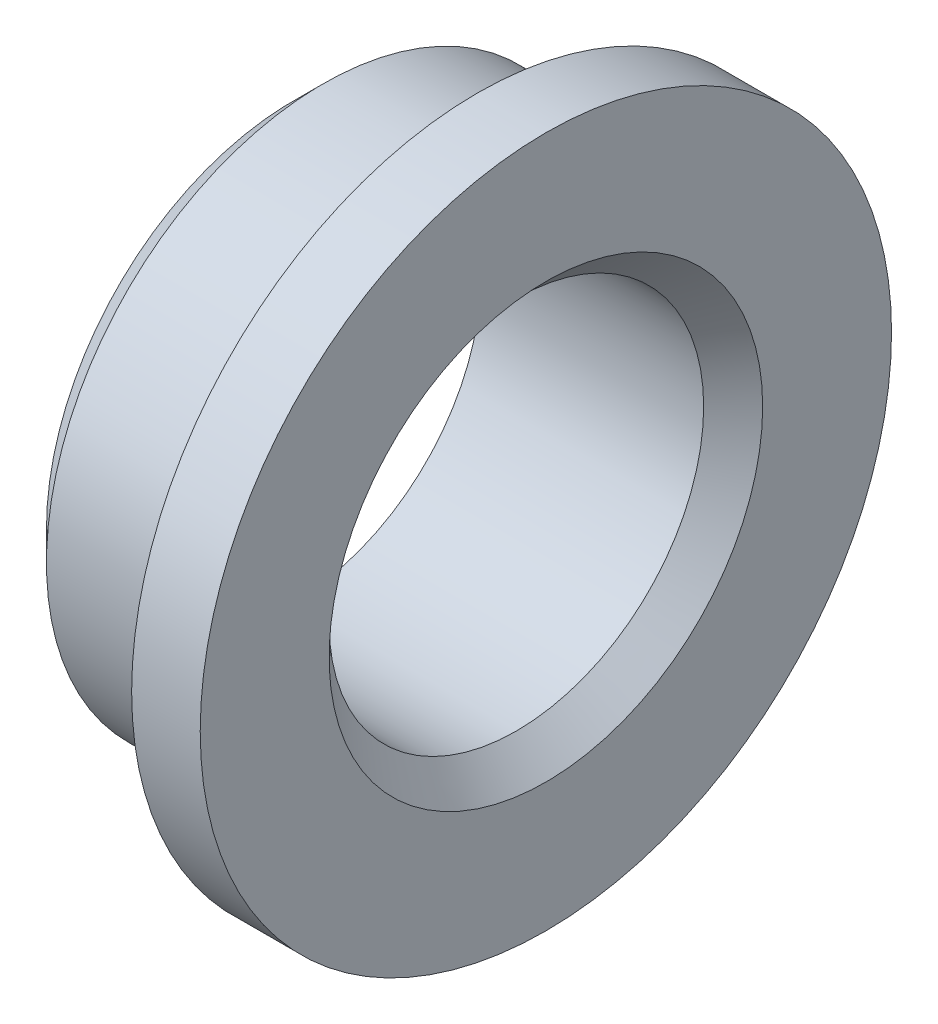
ISO-10303-21;
HEADER;
FILE_DESCRIPTION(('STEP AP214'),'2;1');
FILE_NAME('part.step','',(''),(''),'','','');
FILE_SCHEMA(('AUTOMOTIVE_DESIGN { 1 0 10303 214 1 1 1 1 }'));
ENDSEC;
DATA;
#1=APPLICATION_CONTEXT('core data for automotive mechanical design processes');
#2=APPLICATION_PROTOCOL_DEFINITION('international standard','automotive_design',2000,#1);
#3=PRODUCT_CONTEXT('',#1,'mechanical');
#4=PRODUCT('Part','Part','',(#3));
#5=PRODUCT_RELATED_PRODUCT_CATEGORY('part','',(#4));
#6=PRODUCT_DEFINITION_FORMATION('','',#4);
#7=PRODUCT_DEFINITION_CONTEXT('part definition',#1,'design');
#8=PRODUCT_DEFINITION('design','',#6,#7);
#9=PRODUCT_DEFINITION_SHAPE('','',#8);
#10=(LENGTH_UNIT() NAMED_UNIT(*) SI_UNIT(.MILLI.,.METRE.));
#11=(NAMED_UNIT(*) PLANE_ANGLE_UNIT() SI_UNIT($,.RADIAN.));
#12=(NAMED_UNIT(*) SI_UNIT($,.STERADIAN.) SOLID_ANGLE_UNIT());
#13=UNCERTAINTY_MEASURE_WITH_UNIT(LENGTH_MEASURE(1.E-05),#10,'distance_accuracy_value','');
#14=(GEOMETRIC_REPRESENTATION_CONTEXT(3) GLOBAL_UNCERTAINTY_ASSIGNED_CONTEXT((#13)) GLOBAL_UNIT_ASSIGNED_CONTEXT((#10,
#11,#12)) REPRESENTATION_CONTEXT('',''));
#15=CARTESIAN_POINT('',(0.,0.,0.));
#16=DIRECTION('',(0.,0.,1.));
#17=DIRECTION('',(1.,0.,0.));
#18=AXIS2_PLACEMENT_3D('',#15,#16,#17);
#19=CARTESIAN_POINT('',(8.69315000039705,0.,0.));
#20=DIRECTION('',(1.,0.,0.));
#21=DIRECTION('',(0.,0.,-1.));
#22=AXIS2_PLACEMENT_3D('',#19,#20,#21);
#23=CONICAL_SURFACE('',#22,7.46759999952928,0.785398162502276);
#24=CARTESIAN_POINT('',(8.69315000039705,0.,0.));
#25=DIRECTION('',(1.,0.,0.));
#26=DIRECTION('',(0.,0.,-1.));
#27=AXIS2_PLACEMENT_3D('',#24,#25,#26);
#28=CIRCLE('',#27,7.46759999952928);
#29=CARTESIAN_POINT('',(8.69315000039705,0.,-7.46759999952928));
#30=VERTEX_POINT('',#29);
#31=EDGE_CURVE('E18',#30,#30,#28,.F.);
#32=ORIENTED_EDGE('',*,*,#31,.F.);
#33=EDGE_LOOP('',(#32));
#34=FACE_BOUND('',#33,.T.);
#35=CARTESIAN_POINT('',(7.67715000000003,0.,0.));
#36=DIRECTION('',(1.,0.,0.));
#37=DIRECTION('',(0.,0.,-1.));
#38=AXIS2_PLACEMENT_3D('',#35,#36,#37);
#39=CIRCLE('',#38,6.45160000000003);
#40=CARTESIAN_POINT('',(7.67715000000003,0.,-6.45160000000003));
#41=VERTEX_POINT('',#40);
#42=EDGE_CURVE('E32',#41,#41,#39,.F.);
#43=ORIENTED_EDGE('',*,*,#42,.T.);
#44=EDGE_LOOP('',(#43));
#45=FACE_BOUND('',#44,.T.);
#46=ADVANCED_FACE('F15',(#34,#45),#23,.F.);
#47=CARTESIAN_POINT('',(8.69315,9.68692500000005,0.));
#48=DIRECTION('',(1.,0.,0.));
#49=DIRECTION('',(0.,0.,-1.));
#50=AXIS2_PLACEMENT_3D('',#47,#48,#49);
#51=PLANE('',#50);
#52=ORIENTED_EDGE('',*,*,#31,.T.);
#53=EDGE_LOOP('',(#52));
#54=FACE_BOUND('',#53,.T.);
#55=CARTESIAN_POINT('',(8.69315,0.,0.));
#56=DIRECTION('',(1.,0.,0.));
#57=DIRECTION('',(0.,0.,-1.));
#58=AXIS2_PLACEMENT_3D('',#55,#56,#57);
#59=CIRCLE('',#58,11.9062500000001);
#60=CARTESIAN_POINT('',(8.69315,0.,-11.9062500000001));
#61=VERTEX_POINT('',#60);
#62=EDGE_CURVE('E35',#61,#61,#59,.F.);
#63=ORIENTED_EDGE('',*,*,#62,.F.);
#64=EDGE_LOOP('',(#63));
#65=FACE_BOUND('',#64,.T.);
#66=ADVANCED_FACE('F50',(#54,#65),#51,.T.);
#67=CARTESIAN_POINT('',(3.838575,0.,0.));
#68=DIRECTION('',(1.,0.,0.));
#69=DIRECTION('',(0.,0.,-1.));
#70=AXIS2_PLACEMENT_3D('',#67,#68,#69);
#71=CYLINDRICAL_SURFACE('',#70,6.45160000000003);
#72=ORIENTED_EDGE('',*,*,#42,.F.);
#73=EDGE_LOOP('',(#72));
#74=FACE_BOUND('',#73,.T.);
#75=CARTESIAN_POINT('',(0.,0.,0.));
#76=DIRECTION('',(1.,0.,0.));
#77=DIRECTION('',(0.,0.,-1.));
#78=AXIS2_PLACEMENT_3D('',#75,#76,#77);
#79=CIRCLE('',#78,6.45160000000003);
#80=CARTESIAN_POINT('',(0.,0.,-6.45160000000003));
#81=VERTEX_POINT('',#80);
#82=EDGE_CURVE('E43',#81,#81,#79,.T.);
#83=ORIENTED_EDGE('',*,*,#82,.F.);
#84=EDGE_LOOP('',(#83));
#85=FACE_BOUND('',#84,.T.);
#86=ADVANCED_FACE('F52',(#74,#85),#71,.F.);
#87=CARTESIAN_POINT('',(7.51205000000005,0.,0.));
#88=DIRECTION('',(1.,0.,0.));
#89=DIRECTION('',(0.,0.,-1.));
#90=AXIS2_PLACEMENT_3D('',#87,#88,#89);
#91=CYLINDRICAL_SURFACE('',#90,11.9062500000001);
#92=CARTESIAN_POINT('',(6.3309500000001,0.,0.));
#93=DIRECTION('',(1.,0.,0.));
#94=DIRECTION('',(0.,0.,-1.));
#95=AXIS2_PLACEMENT_3D('',#92,#93,#94);
#96=CIRCLE('',#95,11.9062500000001);
#97=CARTESIAN_POINT('',(6.3309500000001,0.,-11.9062500000001));
#98=VERTEX_POINT('',#97);
#99=EDGE_CURVE('E40',#98,#98,#96,.F.);
#100=ORIENTED_EDGE('',*,*,#99,.F.);
#101=EDGE_LOOP('',(#100));
#102=FACE_BOUND('',#101,.T.);
#103=ORIENTED_EDGE('',*,*,#62,.T.);
#104=EDGE_LOOP('',(#103));
#105=FACE_BOUND('',#104,.T.);
#106=ADVANCED_FACE('F48',(#102,#105),#91,.T.);
#107=CARTESIAN_POINT('',(0.,7.48030000000003,0.));
#108=DIRECTION('',(-1.,0.,0.));
#109=DIRECTION('',(0.,0.,1.));
#110=AXIS2_PLACEMENT_3D('',#107,#108,#109);
#111=PLANE('',#110);
#112=ORIENTED_EDGE('',*,*,#82,.T.);
#113=EDGE_LOOP('',(#112));
#114=FACE_BOUND('',#113,.T.);
#115=CARTESIAN_POINT('',(-4.5590050831712E-10,0.,0.));
#116=DIRECTION('',(1.,0.,0.));
#117=DIRECTION('',(0.,0.,-1.));
#118=AXIS2_PLACEMENT_3D('',#115,#116,#117);
#119=CIRCLE('',#118,8.50900000045593);
#120=CARTESIAN_POINT('',(-4.5590050831712E-10,0.,-8.50900000045593));
#121=VERTEX_POINT('',#120);
#122=EDGE_CURVE('E27',#121,#121,#119,.T.);
#123=ORIENTED_EDGE('',*,*,#122,.F.);
#124=EDGE_LOOP('',(#123));
#125=FACE_BOUND('',#124,.T.);
#126=ADVANCED_FACE('F77',(#114,#125),#111,.T.);
#127=CARTESIAN_POINT('',(6.33095000000005,10.7156250000001,0.));
#128=DIRECTION('',(-1.,0.,0.));
#129=DIRECTION('',(0.,0.,1.));
#130=AXIS2_PLACEMENT_3D('',#127,#128,#129);
#131=PLANE('',#130);
#132=CARTESIAN_POINT('',(6.33095,0.,0.));
#133=DIRECTION('',(1.,0.,0.));
#134=DIRECTION('',(0.,0.,-1.));
#135=AXIS2_PLACEMENT_3D('',#132,#133,#134);
#136=CIRCLE('',#135,9.525);
#137=CARTESIAN_POINT('',(6.33095,0.,-9.525));
#138=VERTEX_POINT('',#137);
#139=EDGE_CURVE('E22',#138,#138,#136,.F.);
#140=ORIENTED_EDGE('',*,*,#139,.F.);
#141=EDGE_LOOP('',(#140));
#142=FACE_BOUND('',#141,.T.);
#143=ORIENTED_EDGE('',*,*,#99,.T.);
#144=EDGE_LOOP('',(#143));
#145=FACE_BOUND('',#144,.T.);
#146=ADVANCED_FACE('F70',(#142,#145),#131,.T.);
#147=CARTESIAN_POINT('',(1.01600000045598,0.,0.));
#148=DIRECTION('',(1.,0.,0.));
#149=DIRECTION('',(0.,0.,-1.));
#150=AXIS2_PLACEMENT_3D('',#147,#148,#149);
#151=CONICAL_SURFACE('',#150,9.5249999995441,0.785398162499955);
#152=ORIENTED_EDGE('',*,*,#122,.T.);
#153=EDGE_LOOP('',(#152));
#154=FACE_BOUND('',#153,.T.);
#155=CARTESIAN_POINT('',(1.01600000000008,0.,0.));
#156=DIRECTION('',(1.,0.,0.));
#157=DIRECTION('',(0.,0.,-1.));
#158=AXIS2_PLACEMENT_3D('',#155,#156,#157);
#159=CIRCLE('',#158,9.525);
#160=CARTESIAN_POINT('',(1.01600000000008,0.,-9.525));
#161=VERTEX_POINT('',#160);
#162=EDGE_CURVE('E10',#161,#161,#159,.T.);
#163=ORIENTED_EDGE('',*,*,#162,.F.);
#164=EDGE_LOOP('',(#163));
#165=FACE_BOUND('',#164,.T.);
#166=ADVANCED_FACE('F65',(#154,#165),#151,.T.);
#167=CARTESIAN_POINT('',(3.67347500000003,0.,0.));
#168=DIRECTION('',(1.,0.,0.));
#169=DIRECTION('',(0.,0.,-1.));
#170=AXIS2_PLACEMENT_3D('',#167,#168,#169);
#171=CYLINDRICAL_SURFACE('',#170,9.525);
#172=ORIENTED_EDGE('',*,*,#162,.T.);
#173=EDGE_LOOP('',(#172));
#174=FACE_BOUND('',#173,.T.);
#175=ORIENTED_EDGE('',*,*,#139,.T.);
#176=EDGE_LOOP('',(#175));
#177=FACE_BOUND('',#176,.T.);
#178=ADVANCED_FACE('F63',(#174,#177),#171,.T.);
#179=CLOSED_SHELL('',(#46,#66,#86,#106,#126,#146,#166,#178));
#180=MANIFOLD_SOLID_BREP('B1',#179);
#181=ADVANCED_BREP_SHAPE_REPRESENTATION('',(#18,#180),#14);
#182=SHAPE_DEFINITION_REPRESENTATION(#9,#181);
ENDSEC;
END-ISO-10303-21;
